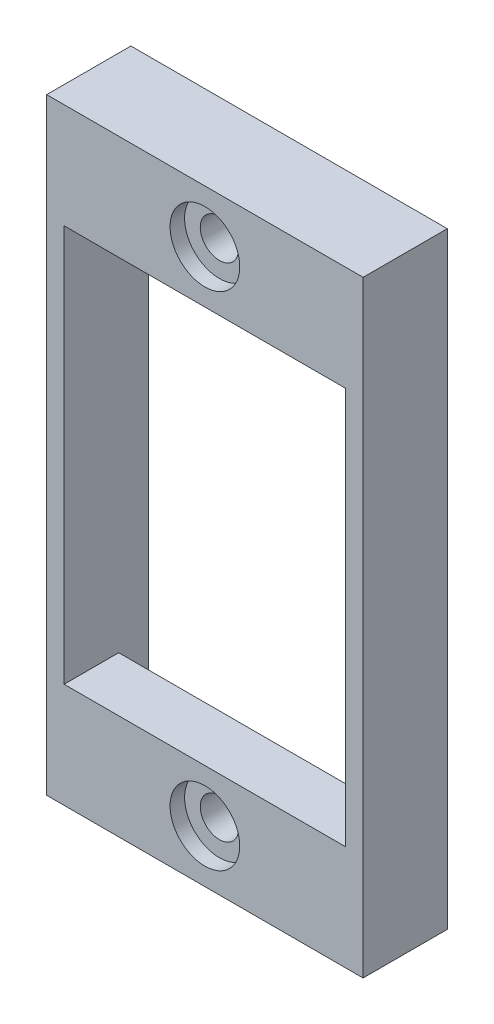
ISO-10303-21;
HEADER;
FILE_DESCRIPTION(('STEP AP214'),'2;1');
FILE_NAME('part.step','',(''),(''),'','','');
FILE_SCHEMA(('AUTOMOTIVE_DESIGN { 1 0 10303 214 1 1 1 1 }'));
ENDSEC;
DATA;
#1=APPLICATION_CONTEXT('core data for automotive mechanical design processes');
#2=APPLICATION_PROTOCOL_DEFINITION('international standard','automotive_design',2000,#1);
#3=PRODUCT_CONTEXT('',#1,'mechanical');
#4=PRODUCT('Part','Part','',(#3));
#5=PRODUCT_RELATED_PRODUCT_CATEGORY('part','',(#4));
#6=PRODUCT_DEFINITION_FORMATION('','',#4);
#7=PRODUCT_DEFINITION_CONTEXT('part definition',#1,'design');
#8=PRODUCT_DEFINITION('design','',#6,#7);
#9=PRODUCT_DEFINITION_SHAPE('','',#8);
#10=(LENGTH_UNIT() NAMED_UNIT(*) SI_UNIT(.MILLI.,.METRE.));
#11=(NAMED_UNIT(*) PLANE_ANGLE_UNIT() SI_UNIT($,.RADIAN.));
#12=(NAMED_UNIT(*) SI_UNIT($,.STERADIAN.) SOLID_ANGLE_UNIT());
#13=UNCERTAINTY_MEASURE_WITH_UNIT(LENGTH_MEASURE(1.E-05),#10,'distance_accuracy_value','');
#14=(GEOMETRIC_REPRESENTATION_CONTEXT(3) GLOBAL_UNCERTAINTY_ASSIGNED_CONTEXT((#13)) GLOBAL_UNIT_ASSIGNED_CONTEXT((#10,
#11,#12)) REPRESENTATION_CONTEXT('',''));
#15=CARTESIAN_POINT('',(0.,0.,0.));
#16=DIRECTION('',(0.,0.,1.));
#17=DIRECTION('',(1.,0.,0.));
#18=AXIS2_PLACEMENT_3D('',#15,#16,#17);
#19=CARTESIAN_POINT('',(0.,0.,0.25));
#20=DIRECTION('',(0.,0.,1.));
#21=DIRECTION('',(1.,0.,0.));
#22=AXIS2_PLACEMENT_3D('',#19,#20,#21);
#23=PLANE('',#22);
#24=CARTESIAN_POINT('',(0.,-21.59,0.25));
#25=DIRECTION('',(0.,0.,-1.));
#26=DIRECTION('',(-1.,0.,0.));
#27=AXIS2_PLACEMENT_3D('',#24,#25,#26);
#28=CIRCLE('',#27,1.65);
#29=CARTESIAN_POINT('',(-1.65,-21.59,0.25));
#30=VERTEX_POINT('',#29);
#31=EDGE_CURVE('E275',#30,#30,#28,.T.);
#32=ORIENTED_EDGE('',*,*,#31,.F.);
#33=EDGE_LOOP('',(#32));
#34=FACE_BOUND('',#33,.T.);
#35=DIRECTION('',(1.,0.,0.));
#36=VECTOR('',#35,1.);
#37=CARTESIAN_POINT('',(-12.12,-17.09,0.25));
#38=LINE('',#37,#36);
#39=CARTESIAN_POINT('',(-12.12,-17.09,0.25));
#40=VERTEX_POINT('',#39);
#41=CARTESIAN_POINT('',(12.12,-17.09,0.25));
#42=VERTEX_POINT('',#41);
#43=EDGE_CURVE('E182',#40,#42,#38,.T.);
#44=ORIENTED_EDGE('',*,*,#43,.T.);
#45=DIRECTION('',(0.,1.,0.));
#46=VECTOR('',#45,1.);
#47=CARTESIAN_POINT('',(12.12,-24.62,0.25));
#48=LINE('',#47,#46);
#49=CARTESIAN_POINT('',(12.12,-24.62,0.25));
#50=VERTEX_POINT('',#49);
#51=EDGE_CURVE('E200',#50,#42,#48,.T.);
#52=ORIENTED_EDGE('',*,*,#51,.F.);
#53=DIRECTION('',(1.,0.,0.));
#54=VECTOR('',#53,1.);
#55=CARTESIAN_POINT('',(-12.12,-24.62,0.25));
#56=LINE('',#55,#54);
#57=CARTESIAN_POINT('',(-12.12,-24.62,0.25));
#58=VERTEX_POINT('',#57);
#59=EDGE_CURVE('E181',#58,#50,#56,.T.);
#60=ORIENTED_EDGE('',*,*,#59,.F.);
#61=DIRECTION('',(0.,-1.,0.));
#62=VECTOR('',#61,1.);
#63=CARTESIAN_POINT('',(-12.12,-24.62,0.25));
#64=LINE('',#63,#62);
#65=EDGE_CURVE('E206',#40,#58,#64,.T.);
#66=ORIENTED_EDGE('',*,*,#65,.F.);
#67=EDGE_LOOP('',(#44,#52,#60,#66));
#68=FACE_BOUND('',#67,.T.);
#69=ADVANCED_FACE('F34',(#34,#68),#23,.F.);
#70=CARTESIAN_POINT('',(-12.12,-17.09,1.25));
#71=DIRECTION('',(0.,1.,0.));
#72=DIRECTION('',(-1.,0.,0.));
#73=AXIS2_PLACEMENT_3D('',#70,#71,#72);
#74=PLANE('',#73);
#75=ORIENTED_EDGE('',*,*,#43,.F.);
#76=DIRECTION('',(0.,0.,-1.));
#77=VECTOR('',#76,1.);
#78=CARTESIAN_POINT('',(-12.12,-17.09,-2.3));
#79=LINE('',#78,#77);
#80=CARTESIAN_POINT('',(-12.12,-17.09,4.95));
#81=VERTEX_POINT('',#80);
#82=EDGE_CURVE('E368',#81,#40,#79,.T.);
#83=ORIENTED_EDGE('',*,*,#82,.F.);
#84=DIRECTION('',(1.,0.,0.));
#85=VECTOR('',#84,1.);
#86=CARTESIAN_POINT('',(-4.62,-17.09,4.95));
#87=LINE('',#86,#85);
#88=CARTESIAN_POINT('',(12.12,-17.09,4.95));
#89=VERTEX_POINT('',#88);
#90=EDGE_CURVE('E278',#81,#89,#87,.T.);
#91=ORIENTED_EDGE('',*,*,#90,.T.);
#92=DIRECTION('',(0.,0.,-1.));
#93=VECTOR('',#92,1.);
#94=CARTESIAN_POINT('',(12.12,-17.09,39.696725025533));
#95=LINE('',#94,#93);
#96=EDGE_CURVE('E193',#89,#42,#95,.T.);
#97=ORIENTED_EDGE('',*,*,#96,.T.);
#98=EDGE_LOOP('',(#75,#83,#91,#97));
#99=FACE_BOUND('',#98,.T.);
#100=ADVANCED_FACE('F358',(#99),#74,.T.);
#101=CARTESIAN_POINT('',(-12.12,17.09,1.25));
#102=DIRECTION('',(0.,-1.,0.));
#103=DIRECTION('',(1.,0.,0.));
#104=AXIS2_PLACEMENT_3D('',#101,#102,#103);
#105=PLANE('',#104);
#106=DIRECTION('',(1.,0.,0.));
#107=VECTOR('',#106,1.);
#108=CARTESIAN_POINT('',(-13.62,17.09,4.95));
#109=LINE('',#108,#107);
#110=CARTESIAN_POINT('',(-12.12,17.09,4.95));
#111=VERTEX_POINT('',#110);
#112=CARTESIAN_POINT('',(12.12,17.09,4.95));
#113=VERTEX_POINT('',#112);
#114=EDGE_CURVE('E294',#111,#113,#109,.T.);
#115=ORIENTED_EDGE('',*,*,#114,.F.);
#116=DIRECTION('',(0.,0.,1.));
#117=VECTOR('',#116,1.);
#118=CARTESIAN_POINT('',(-12.12,17.09,-2.3));
#119=LINE('',#118,#117);
#120=CARTESIAN_POINT('',(-12.12,17.09,0.25));
#121=VERTEX_POINT('',#120);
#122=EDGE_CURVE('E177',#121,#111,#119,.T.);
#123=ORIENTED_EDGE('',*,*,#122,.F.);
#124=DIRECTION('',(-1.,0.,0.));
#125=VECTOR('',#124,1.);
#126=CARTESIAN_POINT('',(-12.12,17.09,0.25));
#127=LINE('',#126,#125);
#128=CARTESIAN_POINT('',(12.12,17.09,0.25));
#129=VERTEX_POINT('',#128);
#130=EDGE_CURVE('E172',#129,#121,#127,.T.);
#131=ORIENTED_EDGE('',*,*,#130,.F.);
#132=DIRECTION('',(0.,0.,-1.));
#133=VECTOR('',#132,1.);
#134=CARTESIAN_POINT('',(12.12,17.09,39.696725025533));
#135=LINE('',#134,#133);
#136=EDGE_CURVE('E176',#113,#129,#135,.T.);
#137=ORIENTED_EDGE('',*,*,#136,.F.);
#138=EDGE_LOOP('',(#115,#123,#131,#137));
#139=FACE_BOUND('',#138,.T.);
#140=ADVANCED_FACE('F175',(#139),#105,.T.);
#141=CARTESIAN_POINT('',(12.12,-24.62,-1.7));
#142=DIRECTION('',(1.,0.,0.));
#143=DIRECTION('',(0.,1.,0.));
#144=AXIS2_PLACEMENT_3D('',#141,#142,#143);
#145=PLANE('',#144);
#146=ORIENTED_EDGE('',*,*,#51,.T.);
#147=ORIENTED_EDGE('',*,*,#96,.F.);
#148=DIRECTION('',(0.,1.,0.));
#149=VECTOR('',#148,1.);
#150=CARTESIAN_POINT('',(12.12,-17.09,4.95));
#151=LINE('',#150,#149);
#152=EDGE_CURVE('E192',#89,#113,#151,.T.);
#153=ORIENTED_EDGE('',*,*,#152,.T.);
#154=ORIENTED_EDGE('',*,*,#136,.T.);
#155=CARTESIAN_POINT('',(12.12,24.62,0.25));
#156=VERTEX_POINT('',#155);
#157=EDGE_CURVE('E188',#129,#156,#48,.T.);
#158=ORIENTED_EDGE('',*,*,#157,.T.);
#159=DIRECTION('',(0.,0.,1.));
#160=VECTOR('',#159,1.);
#161=CARTESIAN_POINT('',(12.12,24.62,-1.7));
#162=LINE('',#161,#160);
#163=CARTESIAN_POINT('',(12.12,24.62,-2.3));
#164=VERTEX_POINT('',#163);
#165=EDGE_CURVE('E217',#164,#156,#162,.T.);
#166=ORIENTED_EDGE('',*,*,#165,.F.);
#167=DIRECTION('',(0.,1.,0.));
#168=VECTOR('',#167,1.);
#169=CARTESIAN_POINT('',(12.12,-24.62,-2.3));
#170=LINE('',#169,#168);
#171=CARTESIAN_POINT('',(12.12,-24.62,-2.3));
#172=VERTEX_POINT('',#171);
#173=EDGE_CURVE('E312',#172,#164,#170,.T.);
#174=ORIENTED_EDGE('',*,*,#173,.F.);
#175=DIRECTION('',(0.,0.,1.));
#176=VECTOR('',#175,1.);
#177=CARTESIAN_POINT('',(12.12,-24.62,-1.7));
#178=LINE('',#177,#176);
#179=EDGE_CURVE('E209',#172,#50,#178,.T.);
#180=ORIENTED_EDGE('',*,*,#179,.T.);
#181=EDGE_LOOP('',(#146,#147,#153,#154,#158,#166,#174,#180));
#182=FACE_BOUND('',#181,.T.);
#183=ADVANCED_FACE('F187',(#182),#145,.F.);
#184=CARTESIAN_POINT('',(0.,21.59,9.61690475583121));
#185=DIRECTION('',(0.,0.,-1.));
#186=DIRECTION('',(-1.,0.,0.));
#187=AXIS2_PLACEMENT_3D('',#184,#185,#186);
#188=CYLINDRICAL_SURFACE('',#187,1.65);
#189=CARTESIAN_POINT('',(0.,21.59,0.25));
#190=DIRECTION('',(0.,0.,-1.));
#191=DIRECTION('',(-1.,0.,0.));
#192=AXIS2_PLACEMENT_3D('',#189,#190,#191);
#193=CIRCLE('',#192,1.65);
#194=CARTESIAN_POINT('',(-1.65,21.59,0.25));
#195=VERTEX_POINT('',#194);
#196=EDGE_CURVE('E258',#195,#195,#193,.T.);
#197=ORIENTED_EDGE('',*,*,#196,.T.);
#198=EDGE_LOOP('',(#197));
#199=FACE_BOUND('',#198,.T.);
#200=CARTESIAN_POINT('',(0.,21.59,3.7));
#201=DIRECTION('',(0.,0.,1.));
#202=DIRECTION('',(1.,0.,0.));
#203=AXIS2_PLACEMENT_3D('',#200,#201,#202);
#204=CIRCLE('',#203,1.65);
#205=CARTESIAN_POINT('',(1.65,21.59,3.7));
#206=VERTEX_POINT('',#205);
#207=EDGE_CURVE('E38',#206,#206,#204,.F.);
#208=ORIENTED_EDGE('',*,*,#207,.F.);
#209=EDGE_LOOP('',(#208));
#210=FACE_BOUND('',#209,.T.);
#211=ADVANCED_FACE('F426',(#199,#210),#188,.F.);
#212=CARTESIAN_POINT('',(-12.12,24.62,-1.7));
#213=DIRECTION('',(0.,1.,0.));
#214=DIRECTION('',(-1.,0.,0.));
#215=AXIS2_PLACEMENT_3D('',#212,#213,#214);
#216=PLANE('',#215);
#217=DIRECTION('',(-1.,0.,0.));
#218=VECTOR('',#217,1.);
#219=CARTESIAN_POINT('',(1.5,24.62,-1.5));
#220=LINE('',#219,#218);
#221=CARTESIAN_POINT('',(2.36602540378444,24.62,-1.5));
#222=VERTEX_POINT('',#221);
#223=CARTESIAN_POINT('',(-2.36602540378444,24.62,-1.5));
#224=VERTEX_POINT('',#223);
#225=EDGE_CURVE('E59',#222,#224,#220,.T.);
#226=ORIENTED_EDGE('',*,*,#225,.F.);
#227=DIRECTION('',(0.,0.,-1.));
#228=VECTOR('',#227,1.);
#229=CARTESIAN_POINT('',(2.36602540378444,24.62,-1.7));
#230=LINE('',#229,#228);
#231=CARTESIAN_POINT('',(2.36602540378445,24.62,-2.3));
#232=VERTEX_POINT('',#231);
#233=EDGE_CURVE('E237',#222,#232,#230,.T.);
#234=ORIENTED_EDGE('',*,*,#233,.T.);
#235=DIRECTION('',(-1.,0.,0.));
#236=VECTOR('',#235,1.);
#237=CARTESIAN_POINT('',(12.12,24.62,-2.3));
#238=LINE('',#237,#236);
#239=EDGE_CURVE('E315',#164,#232,#238,.T.);
#240=ORIENTED_EDGE('',*,*,#239,.F.);
#241=ORIENTED_EDGE('',*,*,#165,.T.);
#242=DIRECTION('',(-1.,0.,0.));
#243=VECTOR('',#242,1.);
#244=CARTESIAN_POINT('',(-12.12,24.62,0.25));
#245=LINE('',#244,#243);
#246=CARTESIAN_POINT('',(-12.12,24.62,0.25));
#247=VERTEX_POINT('',#246);
#248=EDGE_CURVE('E198',#156,#247,#245,.T.);
#249=ORIENTED_EDGE('',*,*,#248,.T.);
#250=DIRECTION('',(0.,0.,1.));
#251=VECTOR('',#250,1.);
#252=CARTESIAN_POINT('',(-12.12,24.62,-1.7));
#253=LINE('',#252,#251);
#254=CARTESIAN_POINT('',(-12.12,24.62,-2.3));
#255=VERTEX_POINT('',#254);
#256=EDGE_CURVE('E214',#255,#247,#253,.T.);
#257=ORIENTED_EDGE('',*,*,#256,.F.);
#258=DIRECTION('',(-1.,0.,0.));
#259=VECTOR('',#258,1.);
#260=CARTESIAN_POINT('',(-1.5,24.62,-2.3));
#261=LINE('',#260,#259);
#262=CARTESIAN_POINT('',(-2.36602540378444,24.62,-2.3));
#263=VERTEX_POINT('',#262);
#264=EDGE_CURVE('E321',#263,#255,#261,.T.);
#265=ORIENTED_EDGE('',*,*,#264,.F.);
#266=DIRECTION('',(0.,0.,1.));
#267=VECTOR('',#266,1.);
#268=CARTESIAN_POINT('',(-2.36602540378444,24.62,-1.7));
#269=LINE('',#268,#267);
#270=EDGE_CURVE('E235',#263,#224,#269,.T.);
#271=ORIENTED_EDGE('',*,*,#270,.T.);
#272=EDGE_LOOP('',(#226,#234,#240,#241,#249,#257,#265,#271));
#273=FACE_BOUND('',#272,.T.);
#274=ADVANCED_FACE('F422',(#273),#216,.F.);
#275=CARTESIAN_POINT('',(-13.62,-26.12,-1.7));
#276=DIRECTION('',(0.,-1.,0.));
#277=DIRECTION('',(0.,0.,-1.));
#278=AXIS2_PLACEMENT_3D('',#275,#276,#277);
#279=PLANE('',#278);
#280=DIRECTION('',(0.,0.,1.));
#281=VECTOR('',#280,1.);
#282=CARTESIAN_POINT('',(13.62,-26.12,-1.7));
#283=LINE('',#282,#281);
#284=CARTESIAN_POINT('',(13.62,-26.12,-2.3));
#285=VERTEX_POINT('',#284);
#286=CARTESIAN_POINT('',(13.62,-26.12,4.95));
#287=VERTEX_POINT('',#286);
#288=EDGE_CURVE('E213',#285,#287,#283,.T.);
#289=ORIENTED_EDGE('',*,*,#288,.T.);
#290=DIRECTION('',(1.,0.,0.));
#291=VECTOR('',#290,1.);
#292=CARTESIAN_POINT('',(-13.62,-26.12,4.95));
#293=LINE('',#292,#291);
#294=CARTESIAN_POINT('',(-13.62,-26.12,4.95));
#295=VERTEX_POINT('',#294);
#296=EDGE_CURVE('E285',#295,#287,#293,.T.);
#297=ORIENTED_EDGE('',*,*,#296,.F.);
#298=DIRECTION('',(0.,0.,1.));
#299=VECTOR('',#298,1.);
#300=CARTESIAN_POINT('',(-13.62,-26.12,-1.7));
#301=LINE('',#300,#299);
#302=CARTESIAN_POINT('',(-13.62,-26.12,-2.3));
#303=VERTEX_POINT('',#302);
#304=EDGE_CURVE('E221',#303,#295,#301,.T.);
#305=ORIENTED_EDGE('',*,*,#304,.F.);
#306=DIRECTION('',(-1.,0.,0.));
#307=VECTOR('',#306,1.);
#308=CARTESIAN_POINT('',(13.62,-26.12,-2.3));
#309=LINE('',#308,#307);
#310=EDGE_CURVE('E296',#285,#303,#309,.T.);
#311=ORIENTED_EDGE('',*,*,#310,.F.);
#312=EDGE_LOOP('',(#289,#297,#305,#311));
#313=FACE_BOUND('',#312,.T.);
#314=ADVANCED_FACE('F425',(#313),#279,.T.);
#315=CARTESIAN_POINT('',(-13.62,-26.12,-1.7));
#316=DIRECTION('',(-1.,0.,0.));
#317=DIRECTION('',(0.,0.,1.));
#318=AXIS2_PLACEMENT_3D('',#315,#316,#317);
#319=PLANE('',#318);
#320=DIRECTION('',(0.,0.,1.));
#321=VECTOR('',#320,1.);
#322=CARTESIAN_POINT('',(-13.62,26.12,-1.7));
#323=LINE('',#322,#321);
#324=CARTESIAN_POINT('',(-13.62,26.12,-2.3));
#325=VERTEX_POINT('',#324);
#326=CARTESIAN_POINT('',(-13.62,26.12,4.95));
#327=VERTEX_POINT('',#326);
#328=EDGE_CURVE('E224',#325,#327,#323,.T.);
#329=ORIENTED_EDGE('',*,*,#328,.F.);
#330=DIRECTION('',(0.,1.,0.));
#331=VECTOR('',#330,1.);
#332=CARTESIAN_POINT('',(-13.62,-26.12,-2.3));
#333=LINE('',#332,#331);
#334=EDGE_CURVE('E299',#303,#325,#333,.T.);
#335=ORIENTED_EDGE('',*,*,#334,.F.);
#336=ORIENTED_EDGE('',*,*,#304,.T.);
#337=DIRECTION('',(0.,-1.,0.));
#338=VECTOR('',#337,1.);
#339=CARTESIAN_POINT('',(-13.62,-17.09,4.95));
#340=LINE('',#339,#338);
#341=EDGE_CURVE('E282',#327,#295,#340,.T.);
#342=ORIENTED_EDGE('',*,*,#341,.F.);
#343=EDGE_LOOP('',(#329,#335,#336,#342));
#344=FACE_BOUND('',#343,.T.);
#345=ADVANCED_FACE('F429',(#344),#319,.T.);
#346=CARTESIAN_POINT('',(-13.62,26.12,-1.7));
#347=DIRECTION('',(0.,1.,0.));
#348=DIRECTION('',(0.,0.,1.));
#349=AXIS2_PLACEMENT_3D('',#346,#347,#348);
#350=PLANE('',#349);
#351=ORIENTED_EDGE('',*,*,#328,.T.);
#352=DIRECTION('',(-1.,0.,0.));
#353=VECTOR('',#352,1.);
#354=CARTESIAN_POINT('',(13.62,26.12,4.95));
#355=LINE('',#354,#353);
#356=CARTESIAN_POINT('',(13.62,26.12,4.95));
#357=VERTEX_POINT('',#356);
#358=EDGE_CURVE('E291',#357,#327,#355,.T.);
#359=ORIENTED_EDGE('',*,*,#358,.F.);
#360=DIRECTION('',(0.,0.,1.));
#361=VECTOR('',#360,1.);
#362=CARTESIAN_POINT('',(13.62,26.12,-1.7));
#363=LINE('',#362,#361);
#364=CARTESIAN_POINT('',(13.62,26.12,-2.3));
#365=VERTEX_POINT('',#364);
#366=EDGE_CURVE('E227',#365,#357,#363,.T.);
#367=ORIENTED_EDGE('',*,*,#366,.F.);
#368=DIRECTION('',(1.,0.,0.));
#369=VECTOR('',#368,1.);
#370=CARTESIAN_POINT('',(-13.62,26.12,-2.3));
#371=LINE('',#370,#369);
#372=EDGE_CURVE('E324',#325,#365,#371,.T.);
#373=ORIENTED_EDGE('',*,*,#372,.F.);
#374=EDGE_LOOP('',(#351,#359,#367,#373));
#375=FACE_BOUND('',#374,.T.);
#376=ADVANCED_FACE('F432',(#375),#350,.T.);
#377=CARTESIAN_POINT('',(13.62,-26.12,-1.7));
#378=DIRECTION('',(1.,0.,0.));
#379=DIRECTION('',(0.,1.,0.));
#380=AXIS2_PLACEMENT_3D('',#377,#378,#379);
#381=PLANE('',#380);
#382=ORIENTED_EDGE('',*,*,#366,.T.);
#383=DIRECTION('',(0.,1.,0.));
#384=VECTOR('',#383,1.);
#385=CARTESIAN_POINT('',(13.62,-26.12,4.95));
#386=LINE('',#385,#384);
#387=EDGE_CURVE('E288',#287,#357,#386,.T.);
#388=ORIENTED_EDGE('',*,*,#387,.F.);
#389=ORIENTED_EDGE('',*,*,#288,.F.);
#390=DIRECTION('',(0.,-1.,0.));
#391=VECTOR('',#390,1.);
#392=CARTESIAN_POINT('',(13.62,26.12,-2.3));
#393=LINE('',#392,#391);
#394=EDGE_CURVE('E327',#365,#285,#393,.T.);
#395=ORIENTED_EDGE('',*,*,#394,.F.);
#396=EDGE_LOOP('',(#382,#388,#389,#395));
#397=FACE_BOUND('',#396,.T.);
#398=ADVANCED_FACE('F419',(#397),#381,.T.);
#399=CARTESIAN_POINT('',(-12.12,-24.62,-1.7));
#400=DIRECTION('',(0.,-1.,0.));
#401=DIRECTION('',(0.,0.,-1.));
#402=AXIS2_PLACEMENT_3D('',#399,#400,#401);
#403=PLANE('',#402);
#404=DIRECTION('',(1.,0.,0.));
#405=VECTOR('',#404,1.);
#406=CARTESIAN_POINT('',(1.5,-24.62,-2.3));
#407=LINE('',#406,#405);
#408=CARTESIAN_POINT('',(2.36602540378444,-24.62,-2.3));
#409=VERTEX_POINT('',#408);
#410=EDGE_CURVE('E310',#409,#172,#407,.T.);
#411=ORIENTED_EDGE('',*,*,#410,.F.);
#412=DIRECTION('',(0.,0.,-1.));
#413=VECTOR('',#412,1.);
#414=CARTESIAN_POINT('',(2.36602540378444,-24.62,-1.7));
#415=LINE('',#414,#413);
#416=CARTESIAN_POINT('',(2.36602540378444,-24.62,-1.5));
#417=VERTEX_POINT('',#416);
#418=EDGE_CURVE('E232',#409,#417,#415,.F.);
#419=ORIENTED_EDGE('',*,*,#418,.T.);
#420=DIRECTION('',(-1.,0.,0.));
#421=VECTOR('',#420,1.);
#422=CARTESIAN_POINT('',(1.5,-24.62,-1.5));
#423=LINE('',#422,#421);
#424=CARTESIAN_POINT('',(-2.36602540378444,-24.62,-1.5));
#425=VERTEX_POINT('',#424);
#426=EDGE_CURVE('E330',#417,#425,#423,.T.);
#427=ORIENTED_EDGE('',*,*,#426,.T.);
#428=DIRECTION('',(0.,0.,1.));
#429=VECTOR('',#428,1.);
#430=CARTESIAN_POINT('',(-2.36602540378444,-24.62,-1.7));
#431=LINE('',#430,#429);
#432=CARTESIAN_POINT('',(-2.36602540378444,-24.62,-2.3));
#433=VERTEX_POINT('',#432);
#434=EDGE_CURVE('E223',#425,#433,#431,.F.);
#435=ORIENTED_EDGE('',*,*,#434,.T.);
#436=DIRECTION('',(1.,0.,0.));
#437=VECTOR('',#436,1.);
#438=CARTESIAN_POINT('',(-12.12,-24.62,-2.3));
#439=LINE('',#438,#437);
#440=CARTESIAN_POINT('',(-12.12,-24.62,-2.3));
#441=VERTEX_POINT('',#440);
#442=EDGE_CURVE('E304',#441,#433,#439,.T.);
#443=ORIENTED_EDGE('',*,*,#442,.F.);
#444=DIRECTION('',(0.,0.,1.));
#445=VECTOR('',#444,1.);
#446=CARTESIAN_POINT('',(-12.12,-24.62,-1.7));
#447=LINE('',#446,#445);
#448=EDGE_CURVE('E210',#441,#58,#447,.T.);
#449=ORIENTED_EDGE('',*,*,#448,.T.);
#450=ORIENTED_EDGE('',*,*,#59,.T.);
#451=ORIENTED_EDGE('',*,*,#179,.F.);
#452=EDGE_LOOP('',(#411,#419,#427,#435,#443,#449,#450,#451));
#453=FACE_BOUND('',#452,.T.);
#454=ADVANCED_FACE('F364',(#453),#403,.F.);
#455=CARTESIAN_POINT('',(-12.12,-24.62,-1.7));
#456=DIRECTION('',(-1.,0.,0.));
#457=DIRECTION('',(0.,0.,1.));
#458=AXIS2_PLACEMENT_3D('',#455,#456,#457);
#459=PLANE('',#458);
#460=EDGE_CURVE('E207',#247,#121,#64,.T.);
#461=ORIENTED_EDGE('',*,*,#460,.T.);
#462=ORIENTED_EDGE('',*,*,#122,.T.);
#463=DIRECTION('',(0.,-1.,0.));
#464=VECTOR('',#463,1.);
#465=CARTESIAN_POINT('',(-12.12,24.4935464474804,4.95));
#466=LINE('',#465,#464);
#467=EDGE_CURVE('E51',#111,#81,#466,.T.);
#468=ORIENTED_EDGE('',*,*,#467,.T.);
#469=ORIENTED_EDGE('',*,*,#82,.T.);
#470=ORIENTED_EDGE('',*,*,#65,.T.);
#471=ORIENTED_EDGE('',*,*,#448,.F.);
#472=DIRECTION('',(0.,-1.,0.));
#473=VECTOR('',#472,1.);
#474=CARTESIAN_POINT('',(-12.12,-17.09,-2.3));
#475=LINE('',#474,#473);
#476=EDGE_CURVE('E301',#255,#441,#475,.T.);
#477=ORIENTED_EDGE('',*,*,#476,.F.);
#478=ORIENTED_EDGE('',*,*,#256,.T.);
#479=EDGE_LOOP('',(#461,#462,#468,#469,#470,#471,#477,#478));
#480=FACE_BOUND('',#479,.T.);
#481=ADVANCED_FACE('F367',(#480),#459,.F.);
#482=ORIENTED_EDGE('',*,*,#157,.F.);
#483=ORIENTED_EDGE('',*,*,#130,.T.);
#484=ORIENTED_EDGE('',*,*,#460,.F.);
#485=ORIENTED_EDGE('',*,*,#248,.F.);
#486=EDGE_LOOP('',(#482,#483,#484,#485));
#487=FACE_BOUND('',#486,.T.);
#488=ORIENTED_EDGE('',*,*,#196,.F.);
#489=EDGE_LOOP('',(#488));
#490=FACE_BOUND('',#489,.T.);
#491=ADVANCED_FACE('F195',(#487,#490),#23,.F.);
#492=CARTESIAN_POINT('',(1.5,24.12,-1.5));
#493=DIRECTION('',(0.,0.,-1.));
#494=DIRECTION('',(-1.,0.,0.));
#495=AXIS2_PLACEMENT_3D('',#492,#493,#494);
#496=PLANE('',#495);
#497=ORIENTED_EDGE('',*,*,#225,.T.);
#498=CARTESIAN_POINT('',(-2.36602540378444,23.62,-1.5));
#499=DIRECTION('',(0.,0.,-1.));
#500=DIRECTION('',(-1.,0.,0.));
#501=AXIS2_PLACEMENT_3D('',#498,#499,#500);
#502=CIRCLE('',#501,1.);
#503=CARTESIAN_POINT('',(-1.5,24.12,-1.5));
#504=VERTEX_POINT('',#503);
#505=EDGE_CURVE('E11',#224,#504,#502,.T.);
#506=ORIENTED_EDGE('',*,*,#505,.T.);
#507=DIRECTION('',(-1.,0.,0.));
#508=VECTOR('',#507,1.);
#509=CARTESIAN_POINT('',(1.5,24.12,-1.5));
#510=LINE('',#509,#508);
#511=CARTESIAN_POINT('',(1.5,24.12,-1.5));
#512=VERTEX_POINT('',#511);
#513=EDGE_CURVE('E347',#512,#504,#510,.T.);
#514=ORIENTED_EDGE('',*,*,#513,.F.);
#515=CARTESIAN_POINT('',(2.36602540378444,23.62,-1.5));
#516=DIRECTION('',(0.,0.,-1.));
#517=DIRECTION('',(-1.,0.,0.));
#518=AXIS2_PLACEMENT_3D('',#515,#516,#517);
#519=CIRCLE('',#518,1.);
#520=EDGE_CURVE('E248',#512,#222,#519,.T.);
#521=ORIENTED_EDGE('',*,*,#520,.T.);
#522=EDGE_LOOP('',(#497,#506,#514,#521));
#523=FACE_BOUND('',#522,.T.);
#524=ADVANCED_FACE('F408',(#523),#496,.F.);
#525=CARTESIAN_POINT('',(0.,24.12,0.));
#526=DIRECTION('',(0.,1.,0.));
#527=DIRECTION('',(0.,0.,1.));
#528=AXIS2_PLACEMENT_3D('',#525,#526,#527);
#529=PLANE('',#528);
#530=DIRECTION('',(0.,0.,-1.));
#531=VECTOR('',#530,1.);
#532=CARTESIAN_POINT('',(-1.5,24.12,-1.5));
#533=LINE('',#532,#531);
#534=CARTESIAN_POINT('',(-1.5,24.12,-2.3));
#535=VERTEX_POINT('',#534);
#536=EDGE_CURVE('E341',#504,#535,#533,.T.);
#537=ORIENTED_EDGE('',*,*,#536,.T.);
#538=DIRECTION('',(-1.,0.,0.));
#539=VECTOR('',#538,1.);
#540=CARTESIAN_POINT('',(1.5,24.12,-2.3));
#541=LINE('',#540,#539);
#542=CARTESIAN_POINT('',(1.5,24.12,-2.3));
#543=VERTEX_POINT('',#542);
#544=EDGE_CURVE('E318',#543,#535,#541,.T.);
#545=ORIENTED_EDGE('',*,*,#544,.F.);
#546=DIRECTION('',(0.,0.,1.));
#547=VECTOR('',#546,1.);
#548=CARTESIAN_POINT('',(1.5,24.12,-1.5));
#549=LINE('',#548,#547);
#550=EDGE_CURVE('E344',#543,#512,#549,.T.);
#551=ORIENTED_EDGE('',*,*,#550,.T.);
#552=ORIENTED_EDGE('',*,*,#513,.T.);
#553=EDGE_LOOP('',(#537,#545,#551,#552));
#554=FACE_BOUND('',#553,.T.);
#555=ADVANCED_FACE('F413',(#554),#529,.F.);
#556=CARTESIAN_POINT('',(1.5,-24.12,-1.5));
#557=DIRECTION('',(0.,0.,1.));
#558=DIRECTION('',(1.,0.,0.));
#559=AXIS2_PLACEMENT_3D('',#556,#557,#558);
#560=PLANE('',#559);
#561=ORIENTED_EDGE('',*,*,#426,.F.);
#562=CARTESIAN_POINT('',(2.36602540378444,-23.62,-1.5));
#563=DIRECTION('',(0.,0.,1.));
#564=DIRECTION('',(1.,0.,0.));
#565=AXIS2_PLACEMENT_3D('',#562,#563,#564);
#566=CIRCLE('',#565,1.);
#567=CARTESIAN_POINT('',(1.5,-24.12,-1.5));
#568=VERTEX_POINT('',#567);
#569=EDGE_CURVE('E239',#417,#568,#566,.F.);
#570=ORIENTED_EDGE('',*,*,#569,.T.);
#571=DIRECTION('',(-1.,0.,0.));
#572=VECTOR('',#571,1.);
#573=CARTESIAN_POINT('',(1.5,-24.12,-1.5));
#574=LINE('',#573,#572);
#575=CARTESIAN_POINT('',(-1.5,-24.12,-1.5));
#576=VERTEX_POINT('',#575);
#577=EDGE_CURVE('E334',#568,#576,#574,.T.);
#578=ORIENTED_EDGE('',*,*,#577,.T.);
#579=CARTESIAN_POINT('',(-2.36602540378444,-23.62,-1.5));
#580=DIRECTION('',(0.,0.,1.));
#581=DIRECTION('',(1.,0.,0.));
#582=AXIS2_PLACEMENT_3D('',#579,#580,#581);
#583=CIRCLE('',#582,1.);
#584=EDGE_CURVE('E245',#576,#425,#583,.F.);
#585=ORIENTED_EDGE('',*,*,#584,.T.);
#586=EDGE_LOOP('',(#561,#570,#578,#585));
#587=FACE_BOUND('',#586,.T.);
#588=ADVANCED_FACE('F482',(#587),#560,.T.);
#589=CARTESIAN_POINT('',(0.,-24.12,0.));
#590=DIRECTION('',(0.,-1.,0.));
#591=DIRECTION('',(0.,0.,1.));
#592=AXIS2_PLACEMENT_3D('',#589,#590,#591);
#593=PLANE('',#592);
#594=DIRECTION('',(0.,0.,-1.));
#595=VECTOR('',#594,1.);
#596=CARTESIAN_POINT('',(-1.5,-24.12,-1.5));
#597=LINE('',#596,#595);
#598=CARTESIAN_POINT('',(-1.5,-24.12,-2.3));
#599=VERTEX_POINT('',#598);
#600=EDGE_CURVE('E331',#576,#599,#597,.T.);
#601=ORIENTED_EDGE('',*,*,#600,.F.);
#602=ORIENTED_EDGE('',*,*,#577,.F.);
#603=DIRECTION('',(0.,0.,1.));
#604=VECTOR('',#603,1.);
#605=CARTESIAN_POINT('',(1.5,-24.12,-1.5));
#606=LINE('',#605,#604);
#607=CARTESIAN_POINT('',(1.5,-24.12,-2.3));
#608=VERTEX_POINT('',#607);
#609=EDGE_CURVE('E337',#608,#568,#606,.T.);
#610=ORIENTED_EDGE('',*,*,#609,.F.);
#611=DIRECTION('',(1.,0.,0.));
#612=VECTOR('',#611,1.);
#613=CARTESIAN_POINT('',(-1.5,-24.12,-2.3));
#614=LINE('',#613,#612);
#615=EDGE_CURVE('E307',#599,#608,#614,.T.);
#616=ORIENTED_EDGE('',*,*,#615,.F.);
#617=EDGE_LOOP('',(#601,#602,#610,#616));
#618=FACE_BOUND('',#617,.T.);
#619=ADVANCED_FACE('F477',(#618),#593,.F.);
#620=CARTESIAN_POINT('',(0.,0.,-2.3));
#621=DIRECTION('',(0.,0.,-1.));
#622=DIRECTION('',(-1.,0.,0.));
#623=AXIS2_PLACEMENT_3D('',#620,#621,#622);
#624=PLANE('',#623);
#625=ORIENTED_EDGE('',*,*,#264,.T.);
#626=ORIENTED_EDGE('',*,*,#476,.T.);
#627=ORIENTED_EDGE('',*,*,#442,.T.);
#628=CARTESIAN_POINT('',(-2.36602540378444,-23.62,-2.3));
#629=DIRECTION('',(0.,0.,-1.));
#630=DIRECTION('',(-1.,0.,0.));
#631=AXIS2_PLACEMENT_3D('',#628,#629,#630);
#632=CIRCLE('',#631,1.);
#633=EDGE_CURVE('E243',#433,#599,#632,.F.);
#634=ORIENTED_EDGE('',*,*,#633,.T.);
#635=ORIENTED_EDGE('',*,*,#615,.T.);
#636=CARTESIAN_POINT('',(2.36602540378444,-23.62,-2.3));
#637=DIRECTION('',(0.,0.,-1.));
#638=DIRECTION('',(-1.,0.,0.));
#639=AXIS2_PLACEMENT_3D('',#636,#637,#638);
#640=CIRCLE('',#639,1.);
#641=EDGE_CURVE('E241',#608,#409,#640,.F.);
#642=ORIENTED_EDGE('',*,*,#641,.T.);
#643=ORIENTED_EDGE('',*,*,#410,.T.);
#644=ORIENTED_EDGE('',*,*,#173,.T.);
#645=ORIENTED_EDGE('',*,*,#239,.T.);
#646=CARTESIAN_POINT('',(2.36602540378444,23.62,-2.3));
#647=DIRECTION('',(0.,0.,-1.));
#648=DIRECTION('',(-1.,0.,0.));
#649=AXIS2_PLACEMENT_3D('',#646,#647,#648);
#650=CIRCLE('',#649,1.);
#651=EDGE_CURVE('E250',#232,#543,#650,.F.);
#652=ORIENTED_EDGE('',*,*,#651,.T.);
#653=ORIENTED_EDGE('',*,*,#544,.T.);
#654=CARTESIAN_POINT('',(-2.36602540378444,23.62,-2.3));
#655=DIRECTION('',(0.,0.,-1.));
#656=DIRECTION('',(-1.,0.,0.));
#657=AXIS2_PLACEMENT_3D('',#654,#655,#656);
#658=CIRCLE('',#657,1.);
#659=EDGE_CURVE('E43',#535,#263,#658,.F.);
#660=ORIENTED_EDGE('',*,*,#659,.T.);
#661=EDGE_LOOP('',(#625,#626,#627,#634,#635,#642,#643,#644,#645,#652,#653,#660));
#662=FACE_BOUND('',#661,.T.);
#663=ORIENTED_EDGE('',*,*,#310,.T.);
#664=ORIENTED_EDGE('',*,*,#334,.T.);
#665=ORIENTED_EDGE('',*,*,#372,.T.);
#666=ORIENTED_EDGE('',*,*,#394,.T.);
#667=EDGE_LOOP('',(#663,#664,#665,#666));
#668=FACE_BOUND('',#667,.T.);
#669=ADVANCED_FACE('F447',(#662,#668),#624,.T.);
#670=CARTESIAN_POINT('',(2.36602540378444,-23.62,-1.5));
#671=DIRECTION('',(0.,0.,-1.));
#672=DIRECTION('',(-1.,0.,0.));
#673=AXIS2_PLACEMENT_3D('',#670,#671,#672);
#674=CYLINDRICAL_SURFACE('',#673,1.);
#675=ORIENTED_EDGE('',*,*,#641,.F.);
#676=ORIENTED_EDGE('',*,*,#609,.T.);
#677=ORIENTED_EDGE('',*,*,#569,.F.);
#678=ORIENTED_EDGE('',*,*,#418,.F.);
#679=EDGE_LOOP('',(#675,#676,#677,#678));
#680=FACE_BOUND('',#679,.T.);
#681=ADVANCED_FACE('F443',(#680),#674,.F.);
#682=CARTESIAN_POINT('',(-2.36602540378444,-23.62,-1.5));
#683=DIRECTION('',(0.,0.,1.));
#684=DIRECTION('',(1.,0.,0.));
#685=AXIS2_PLACEMENT_3D('',#682,#683,#684);
#686=CYLINDRICAL_SURFACE('',#685,1.);
#687=ORIENTED_EDGE('',*,*,#584,.F.);
#688=ORIENTED_EDGE('',*,*,#600,.T.);
#689=ORIENTED_EDGE('',*,*,#633,.F.);
#690=ORIENTED_EDGE('',*,*,#434,.F.);
#691=EDGE_LOOP('',(#687,#688,#689,#690));
#692=FACE_BOUND('',#691,.T.);
#693=ADVANCED_FACE('F446',(#692),#686,.F.);
#694=CARTESIAN_POINT('',(2.36602540378444,23.62,-1.5));
#695=DIRECTION('',(0.,0.,-1.));
#696=DIRECTION('',(-1.,0.,0.));
#697=AXIS2_PLACEMENT_3D('',#694,#695,#696);
#698=CYLINDRICAL_SURFACE('',#697,1.);
#699=ORIENTED_EDGE('',*,*,#651,.F.);
#700=ORIENTED_EDGE('',*,*,#233,.F.);
#701=ORIENTED_EDGE('',*,*,#520,.F.);
#702=ORIENTED_EDGE('',*,*,#550,.F.);
#703=EDGE_LOOP('',(#699,#700,#701,#702));
#704=FACE_BOUND('',#703,.T.);
#705=ADVANCED_FACE('F450',(#704),#698,.F.);
#706=CARTESIAN_POINT('',(-2.36602540378444,23.62,-1.5));
#707=DIRECTION('',(0.,0.,1.));
#708=DIRECTION('',(1.,0.,0.));
#709=AXIS2_PLACEMENT_3D('',#706,#707,#708);
#710=CYLINDRICAL_SURFACE('',#709,1.);
#711=ORIENTED_EDGE('',*,*,#505,.F.);
#712=ORIENTED_EDGE('',*,*,#270,.F.);
#713=ORIENTED_EDGE('',*,*,#659,.F.);
#714=ORIENTED_EDGE('',*,*,#536,.F.);
#715=EDGE_LOOP('',(#711,#712,#713,#714));
#716=FACE_BOUND('',#715,.T.);
#717=ADVANCED_FACE('F36',(#716),#710,.F.);
#718=CARTESIAN_POINT('',(0.,0.,4.95));
#719=DIRECTION('',(0.,0.,-1.));
#720=DIRECTION('',(-1.,0.,0.));
#721=AXIS2_PLACEMENT_3D('',#718,#719,#720);
#722=PLANE('',#721);
#723=ORIENTED_EDGE('',*,*,#152,.F.);
#724=ORIENTED_EDGE('',*,*,#90,.F.);
#725=ORIENTED_EDGE('',*,*,#467,.F.);
#726=ORIENTED_EDGE('',*,*,#114,.T.);
#727=EDGE_LOOP('',(#723,#724,#725,#726));
#728=FACE_BOUND('',#727,.T.);
#729=ORIENTED_EDGE('',*,*,#358,.T.);
#730=ORIENTED_EDGE('',*,*,#341,.T.);
#731=ORIENTED_EDGE('',*,*,#296,.T.);
#732=ORIENTED_EDGE('',*,*,#387,.T.);
#733=EDGE_LOOP('',(#729,#730,#731,#732));
#734=FACE_BOUND('',#733,.T.);
#735=CARTESIAN_POINT('',(0.,21.59,4.95));
#736=DIRECTION('',(0.,0.,1.));
#737=DIRECTION('',(1.,0.,0.));
#738=AXIS2_PLACEMENT_3D('',#735,#736,#737);
#739=CIRCLE('',#738,3.);
#740=CARTESIAN_POINT('',(3.,21.59,4.95));
#741=VERTEX_POINT('',#740);
#742=EDGE_CURVE('E260',#741,#741,#739,.T.);
#743=ORIENTED_EDGE('',*,*,#742,.F.);
#744=EDGE_LOOP('',(#743));
#745=FACE_BOUND('',#744,.T.);
#746=CARTESIAN_POINT('',(0.,-21.59,4.95));
#747=DIRECTION('',(0.,0.,1.));
#748=DIRECTION('',(-1.,0.,0.));
#749=AXIS2_PLACEMENT_3D('',#746,#747,#748);
#750=CIRCLE('',#749,3.);
#751=CARTESIAN_POINT('',(-3.00000000000001,-21.59,4.95));
#752=VERTEX_POINT('',#751);
#753=EDGE_CURVE('E272',#752,#752,#750,.T.);
#754=ORIENTED_EDGE('',*,*,#753,.F.);
#755=EDGE_LOOP('',(#754));
#756=FACE_BOUND('',#755,.T.);
#757=ADVANCED_FACE('F371',(#728,#734,#745,#756),#722,.F.);
#758=CARTESIAN_POINT('',(0.,-21.59,9.61690475583121));
#759=DIRECTION('',(0.,0.,-1.));
#760=DIRECTION('',(-1.,0.,0.));
#761=AXIS2_PLACEMENT_3D('',#758,#759,#760);
#762=CYLINDRICAL_SURFACE('',#761,1.65);
#763=CARTESIAN_POINT('',(0.,-21.59,3.7));
#764=DIRECTION('',(0.,0.,-1.));
#765=DIRECTION('',(-1.,0.,0.));
#766=AXIS2_PLACEMENT_3D('',#763,#764,#765);
#767=CIRCLE('',#766,1.65);
#768=CARTESIAN_POINT('',(-1.65,-21.59,3.7));
#769=VERTEX_POINT('',#768);
#770=EDGE_CURVE('E252',#769,#769,#767,.F.);
#771=ORIENTED_EDGE('',*,*,#770,.T.);
#772=EDGE_LOOP('',(#771));
#773=FACE_BOUND('',#772,.T.);
#774=ORIENTED_EDGE('',*,*,#31,.T.);
#775=EDGE_LOOP('',(#774));
#776=FACE_BOUND('',#775,.T.);
#777=ADVANCED_FACE('F374',(#773,#776),#762,.F.);
#778=CARTESIAN_POINT('',(0.,-21.59,3.7));
#779=DIRECTION('',(0.,0.,-1.));
#780=DIRECTION('',(-1.,0.,0.));
#781=AXIS2_PLACEMENT_3D('',#778,#779,#780);
#782=PLANE('',#781);
#783=CARTESIAN_POINT('',(0.,-21.59,3.7));
#784=DIRECTION('',(0.,0.,1.));
#785=DIRECTION('',(-1.,0.,0.));
#786=AXIS2_PLACEMENT_3D('',#783,#784,#785);
#787=CIRCLE('',#786,3.);
#788=CARTESIAN_POINT('',(-3.00000000000001,-21.59,3.7));
#789=VERTEX_POINT('',#788);
#790=EDGE_CURVE('E265',#789,#789,#787,.T.);
#791=ORIENTED_EDGE('',*,*,#790,.T.);
#792=EDGE_LOOP('',(#791));
#793=FACE_BOUND('',#792,.T.);
#794=ORIENTED_EDGE('',*,*,#770,.F.);
#795=EDGE_LOOP('',(#794));
#796=FACE_BOUND('',#795,.T.);
#797=ADVANCED_FACE('F385',(#793,#796),#782,.F.);
#798=CARTESIAN_POINT('',(0.,-21.59,3.7));
#799=DIRECTION('',(0.,0.,1.));
#800=DIRECTION('',(1.,0.,0.));
#801=AXIS2_PLACEMENT_3D('',#798,#799,#800);
#802=CYLINDRICAL_SURFACE('',#801,3.);
#803=ORIENTED_EDGE('',*,*,#790,.F.);
#804=EDGE_LOOP('',(#803));
#805=FACE_BOUND('',#804,.T.);
#806=ORIENTED_EDGE('',*,*,#753,.T.);
#807=EDGE_LOOP('',(#806));
#808=FACE_BOUND('',#807,.T.);
#809=ADVANCED_FACE('F382',(#805,#808),#802,.F.);
#810=CARTESIAN_POINT('',(0.,21.59,3.7));
#811=DIRECTION('',(0.,0.,1.));
#812=DIRECTION('',(1.,0.,0.));
#813=AXIS2_PLACEMENT_3D('',#810,#811,#812);
#814=PLANE('',#813);
#815=CARTESIAN_POINT('',(0.,21.59,3.7));
#816=DIRECTION('',(0.,0.,1.));
#817=DIRECTION('',(1.,0.,0.));
#818=AXIS2_PLACEMENT_3D('',#815,#816,#817);
#819=CIRCLE('',#818,3.);
#820=CARTESIAN_POINT('',(3.,21.59,3.7));
#821=VERTEX_POINT('',#820);
#822=EDGE_CURVE('E254',#821,#821,#819,.T.);
#823=ORIENTED_EDGE('',*,*,#822,.T.);
#824=EDGE_LOOP('',(#823));
#825=FACE_BOUND('',#824,.T.);
#826=ORIENTED_EDGE('',*,*,#207,.T.);
#827=EDGE_LOOP('',(#826));
#828=FACE_BOUND('',#827,.T.);
#829=ADVANCED_FACE('F384',(#825,#828),#814,.T.);
#830=CARTESIAN_POINT('',(0.,21.59,3.7));
#831=DIRECTION('',(0.,0.,1.));
#832=DIRECTION('',(1.,0.,0.));
#833=AXIS2_PLACEMENT_3D('',#830,#831,#832);
#834=CYLINDRICAL_SURFACE('',#833,3.);
#835=ORIENTED_EDGE('',*,*,#822,.F.);
#836=EDGE_LOOP('',(#835));
#837=FACE_BOUND('',#836,.T.);
#838=ORIENTED_EDGE('',*,*,#742,.T.);
#839=EDGE_LOOP('',(#838));
#840=FACE_BOUND('',#839,.T.);
#841=ADVANCED_FACE('F392',(#837,#840),#834,.F.);
#842=CLOSED_SHELL('',(#69,#100,#140,#183,#211,#274,#314,#345,#376,#398,#454,#481,#491,#524,#555,
#588,#619,#669,#681,#693,#705,#717,#757,#777,#797,#809,#829,#841));
#843=MANIFOLD_SOLID_BREP('B2',#842);
#844=ADVANCED_BREP_SHAPE_REPRESENTATION('',(#18,#843),#14);
#845=SHAPE_DEFINITION_REPRESENTATION(#9,#844);
ENDSEC;
END-ISO-10303-21;
